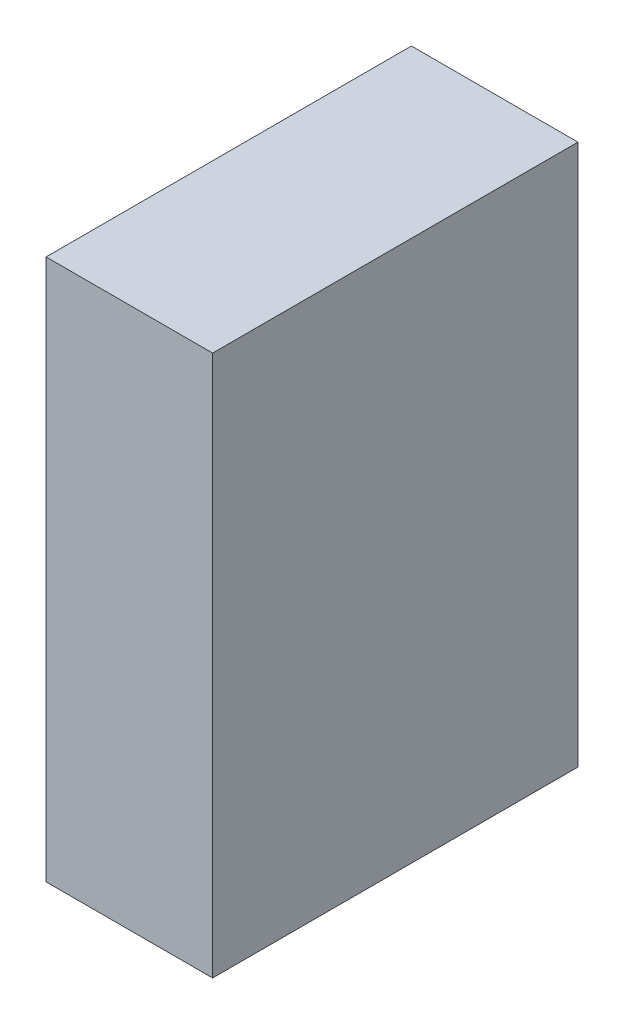
ISO-10303-21;
HEADER;
FILE_DESCRIPTION(('STEP AP214'),'2;1');
FILE_NAME('part.step','',(''),(''),'','','');
FILE_SCHEMA(('AUTOMOTIVE_DESIGN { 1 0 10303 214 1 1 1 1 }'));
ENDSEC;
DATA;
#1=APPLICATION_CONTEXT('core data for automotive mechanical design processes');
#2=APPLICATION_PROTOCOL_DEFINITION('international standard','automotive_design',2000,#1);
#3=PRODUCT_CONTEXT('',#1,'mechanical');
#4=PRODUCT('Part','Part','',(#3));
#5=PRODUCT_RELATED_PRODUCT_CATEGORY('part','',(#4));
#6=PRODUCT_DEFINITION_FORMATION('','',#4);
#7=PRODUCT_DEFINITION_CONTEXT('part definition',#1,'design');
#8=PRODUCT_DEFINITION('design','',#6,#7);
#9=PRODUCT_DEFINITION_SHAPE('','',#8);
#10=(LENGTH_UNIT() NAMED_UNIT(*) SI_UNIT(.MILLI.,.METRE.));
#11=(NAMED_UNIT(*) PLANE_ANGLE_UNIT() SI_UNIT($,.RADIAN.));
#12=(NAMED_UNIT(*) SI_UNIT($,.STERADIAN.) SOLID_ANGLE_UNIT());
#13=UNCERTAINTY_MEASURE_WITH_UNIT(LENGTH_MEASURE(1.E-05),#10,'distance_accuracy_value','');
#14=(GEOMETRIC_REPRESENTATION_CONTEXT(3) GLOBAL_UNCERTAINTY_ASSIGNED_CONTEXT((#13)) GLOBAL_UNIT_ASSIGNED_CONTEXT((#10,
#11,#12)) REPRESENTATION_CONTEXT('',''));
#15=CARTESIAN_POINT('',(0.,0.,0.));
#16=DIRECTION('',(0.,0.,1.));
#17=DIRECTION('',(1.,0.,0.));
#18=AXIS2_PLACEMENT_3D('',#15,#16,#17);
#19=CARTESIAN_POINT('',(0.07999475999998,0.25999694,0.));
#20=DIRECTION('',(0.99999999995228,9.76929806973974E-06,0.));
#21=DIRECTION('',(-9.76929806973974E-06,0.99999999995228,0.));
#22=AXIS2_PLACEMENT_3D('',#19,#20,#21);
#23=PLANE('',#22);
#24=DIRECTION('',(0.,0.,-1.));
#25=VECTOR('',#24,1.);
#26=CARTESIAN_POINT('',(0.07999984,-0.25999948,0.));
#27=LINE('',#26,#25);
#28=CARTESIAN_POINT('',(0.0799998400000012,-0.25999948,0.));
#29=VERTEX_POINT('',#28);
#30=CARTESIAN_POINT('',(0.0799998400000012,-0.25999948,0.35100006));
#31=VERTEX_POINT('',#30);
#32=EDGE_CURVE('E53',#29,#31,#27,.F.);
#33=ORIENTED_EDGE('',*,*,#32,.F.);
#34=DIRECTION('',(-9.76929806973974E-06,0.99999999995228,0.));
#35=VECTOR('',#34,1.);
#36=CARTESIAN_POINT('',(0.07999475999998,0.25999694,0.));
#37=LINE('',#36,#35);
#38=CARTESIAN_POINT('',(0.0799947599999801,0.259996940000003,0.));
#39=VERTEX_POINT('',#38);
#40=EDGE_CURVE('E67',#29,#39,#37,.T.);
#41=ORIENTED_EDGE('',*,*,#40,.T.);
#42=DIRECTION('',(0.,0.,1.));
#43=VECTOR('',#42,1.);
#44=CARTESIAN_POINT('',(0.0799947599999801,0.259996940000003,0.));
#45=LINE('',#44,#43);
#46=CARTESIAN_POINT('',(0.0799947599999801,0.259996940000003,0.35100006));
#47=VERTEX_POINT('',#46);
#48=EDGE_CURVE('E65',#47,#39,#45,.F.);
#49=ORIENTED_EDGE('',*,*,#48,.F.);
#50=DIRECTION('',(-9.76929806973974E-06,0.99999999995228,0.));
#51=VECTOR('',#50,1.);
#52=CARTESIAN_POINT('',(0.0799998399847324,-0.259997916940249,0.35100006));
#53=LINE('',#52,#51);
#54=EDGE_CURVE('E19',#31,#47,#53,.T.);
#55=ORIENTED_EDGE('',*,*,#54,.F.);
#56=EDGE_LOOP('',(#33,#41,#49,#55));
#57=FACE_BOUND('',#56,.T.);
#58=ADVANCED_FACE('F16',(#57),#23,.T.);
#59=CARTESIAN_POINT('',(0.07999984,-0.25999948,0.));
#60=DIRECTION('',(0.,-1.,0.));
#61=DIRECTION('',(0.,0.,-1.));
#62=AXIS2_PLACEMENT_3D('',#59,#60,#61);
#63=PLANE('',#62);
#64=DIRECTION('',(0.,0.,1.));
#65=VECTOR('',#64,1.);
#66=CARTESIAN_POINT('',(-0.0799973,-0.25999948,0.));
#67=LINE('',#66,#65);
#68=CARTESIAN_POINT('',(-0.0799976175,-0.259999479998449,0.));
#69=VERTEX_POINT('',#68);
#70=CARTESIAN_POINT('',(-0.0799975116666667,-0.259999479998966,0.35100006));
#71=VERTEX_POINT('',#70);
#72=EDGE_CURVE('E76',#69,#71,#67,.T.);
#73=ORIENTED_EDGE('',*,*,#72,.F.);
#74=DIRECTION('',(1.,0.,0.));
#75=VECTOR('',#74,1.);
#76=CARTESIAN_POINT('',(-0.0799973,-0.25999948,0.));
#77=LINE('',#76,#75);
#78=EDGE_CURVE('E68',#69,#29,#77,.T.);
#79=ORIENTED_EDGE('',*,*,#78,.T.);
#80=ORIENTED_EDGE('',*,*,#32,.T.);
#81=DIRECTION('',(1.,0.,0.));
#82=VECTOR('',#81,1.);
#83=CARTESIAN_POINT('',(-0.0799973,-0.25999948,0.35100006));
#84=LINE('',#83,#82);
#85=EDGE_CURVE('E63',#71,#31,#84,.T.);
#86=ORIENTED_EDGE('',*,*,#85,.F.);
#87=EDGE_LOOP('',(#73,#79,#80,#86));
#88=FACE_BOUND('',#87,.T.);
#89=ADVANCED_FACE('F98',(#88),#63,.T.);
#90=CARTESIAN_POINT('',(-0.0799973,-0.25999948,0.35100006));
#91=DIRECTION('',(0.,0.,1.));
#92=DIRECTION('',(1.,0.,0.));
#93=AXIS2_PLACEMENT_3D('',#90,#91,#92);
#94=PLANE('',#93);
#95=DIRECTION('',(-0.999999999873984,1.58755357785697E-05,0.));
#96=VECTOR('',#95,1.);
#97=CARTESIAN_POINT('',(-0.07999984,0.25999948,0.35100006));
#98=LINE('',#97,#96);
#99=CARTESIAN_POINT('',(-0.079999839999997,0.25999948,0.35100006));
#100=VERTEX_POINT('',#99);
#101=EDGE_CURVE('E62',#100,#47,#98,.F.);
#102=ORIENTED_EDGE('',*,*,#101,.F.);
#103=DIRECTION('',(4.88462514803434E-06,-0.99999999998807,0.));
#104=VECTOR('',#103,1.);
#105=CARTESIAN_POINT('',(-0.0799973,-0.25999948,0.35100006));
#106=LINE('',#105,#104);
#107=EDGE_CURVE('E82',#71,#100,#106,.F.);
#108=ORIENTED_EDGE('',*,*,#107,.F.);
#109=ORIENTED_EDGE('',*,*,#85,.T.);
#110=ORIENTED_EDGE('',*,*,#54,.T.);
#111=EDGE_LOOP('',(#102,#108,#109,#110));
#112=FACE_BOUND('',#111,.T.);
#113=ADVANCED_FACE('F59',(#112),#94,.T.);
#114=CARTESIAN_POINT('',(-0.07999984,0.25999948,0.));
#115=DIRECTION('',(1.58755357785697E-05,0.999999999873984,0.));
#116=DIRECTION('',(-0.999999999873984,1.58755357785697E-05,0.));
#117=AXIS2_PLACEMENT_3D('',#114,#115,#116);
#118=PLANE('',#117);
#119=ORIENTED_EDGE('',*,*,#48,.T.);
#120=DIRECTION('',(-0.999999999873984,1.58755357785697E-05,0.));
#121=VECTOR('',#120,1.);
#122=CARTESIAN_POINT('',(-0.07999984,0.25999948,0.));
#123=LINE('',#122,#121);
#124=CARTESIAN_POINT('',(-0.079999839999997,0.25999948,0.));
#125=VERTEX_POINT('',#124);
#126=EDGE_CURVE('E34',#39,#125,#123,.T.);
#127=ORIENTED_EDGE('',*,*,#126,.T.);
#128=DIRECTION('',(0.,0.,1.));
#129=VECTOR('',#128,1.);
#130=CARTESIAN_POINT('',(-0.079999839999997,0.25999948,0.));
#131=LINE('',#130,#129);
#132=EDGE_CURVE('E25',#100,#125,#131,.F.);
#133=ORIENTED_EDGE('',*,*,#132,.F.);
#134=ORIENTED_EDGE('',*,*,#101,.T.);
#135=EDGE_LOOP('',(#119,#127,#133,#134));
#136=FACE_BOUND('',#135,.T.);
#137=ADVANCED_FACE('F70',(#136),#118,.T.);
#138=CARTESIAN_POINT('',(-0.0799973,-0.25999948,0.));
#139=DIRECTION('',(0.,0.,1.));
#140=DIRECTION('',(1.,0.,0.));
#141=AXIS2_PLACEMENT_3D('',#138,#139,#140);
#142=PLANE('',#141);
#143=ORIENTED_EDGE('',*,*,#126,.F.);
#144=ORIENTED_EDGE('',*,*,#40,.F.);
#145=ORIENTED_EDGE('',*,*,#78,.F.);
#146=DIRECTION('',(4.88462514803434E-06,-0.99999999998807,0.));
#147=VECTOR('',#146,1.);
#148=CARTESIAN_POINT('',(-0.0799973,-0.25999948,0.));
#149=LINE('',#148,#147);
#150=EDGE_CURVE('E11',#125,#69,#149,.T.);
#151=ORIENTED_EDGE('',*,*,#150,.F.);
#152=EDGE_LOOP('',(#143,#144,#145,#151));
#153=FACE_BOUND('',#152,.T.);
#154=ADVANCED_FACE('F100',(#153),#142,.F.);
#155=CARTESIAN_POINT('',(-0.0799973,-0.25999948,0.));
#156=DIRECTION('',(-0.99999999998807,-4.88462514803434E-06,0.));
#157=DIRECTION('',(4.88462514803434E-06,-0.99999999998807,0.));
#158=AXIS2_PLACEMENT_3D('',#155,#156,#157);
#159=PLANE('',#158);
#160=ORIENTED_EDGE('',*,*,#132,.T.);
#161=ORIENTED_EDGE('',*,*,#150,.T.);
#162=ORIENTED_EDGE('',*,*,#72,.T.);
#163=ORIENTED_EDGE('',*,*,#107,.T.);
#164=EDGE_LOOP('',(#160,#161,#162,#163));
#165=FACE_BOUND('',#164,.T.);
#166=ADVANCED_FACE('F95',(#165),#159,.T.);
#167=CLOSED_SHELL('',(#58,#89,#113,#137,#154,#166));
#168=MANIFOLD_SOLID_BREP('B1',#167);
#169=ADVANCED_BREP_SHAPE_REPRESENTATION('',(#18,#168),#14);
#170=SHAPE_DEFINITION_REPRESENTATION(#9,#169);
ENDSEC;
END-ISO-10303-21;
